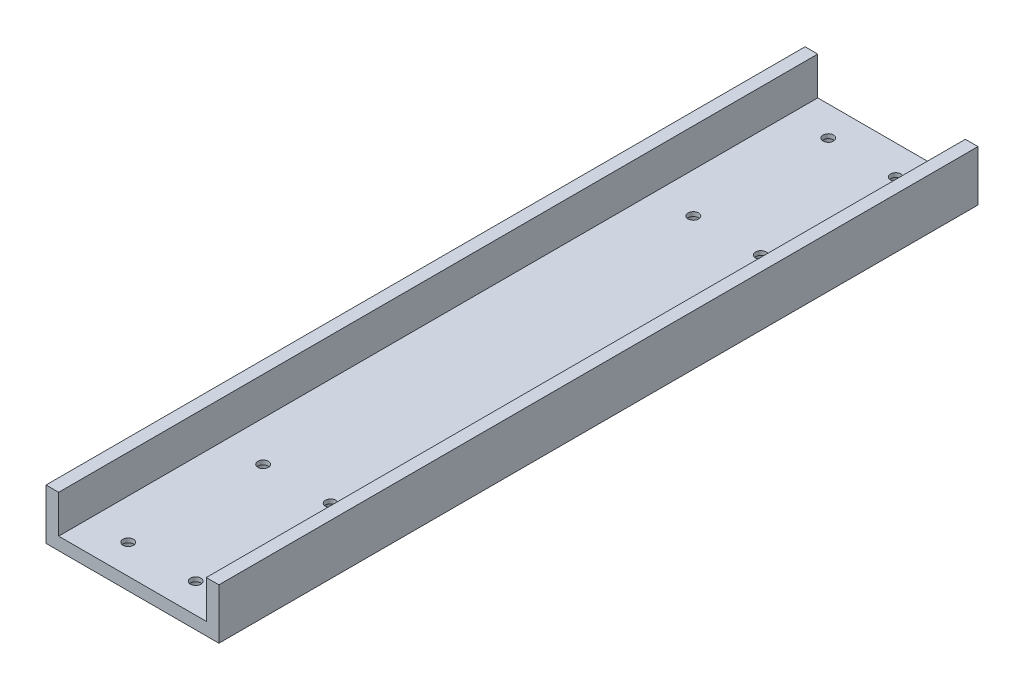
ISO-10303-21;
HEADER;
FILE_DESCRIPTION(('STEP AP214'),'2;1');
FILE_NAME('part.step','',(''),(''),'','','');
FILE_SCHEMA(('AUTOMOTIVE_DESIGN { 1 0 10303 214 1 1 1 1 }'));
ENDSEC;
DATA;
#1=APPLICATION_CONTEXT('core data for automotive mechanical design processes');
#2=APPLICATION_PROTOCOL_DEFINITION('international standard','automotive_design',2000,#1);
#3=PRODUCT_CONTEXT('',#1,'mechanical');
#4=PRODUCT('Part','Part','',(#3));
#5=PRODUCT_RELATED_PRODUCT_CATEGORY('part','',(#4));
#6=PRODUCT_DEFINITION_FORMATION('','',#4);
#7=PRODUCT_DEFINITION_CONTEXT('part definition',#1,'design');
#8=PRODUCT_DEFINITION('design','',#6,#7);
#9=PRODUCT_DEFINITION_SHAPE('','',#8);
#10=(LENGTH_UNIT() NAMED_UNIT(*) SI_UNIT(.MILLI.,.METRE.));
#11=(NAMED_UNIT(*) PLANE_ANGLE_UNIT() SI_UNIT($,.RADIAN.));
#12=(NAMED_UNIT(*) SI_UNIT($,.STERADIAN.) SOLID_ANGLE_UNIT());
#13=UNCERTAINTY_MEASURE_WITH_UNIT(LENGTH_MEASURE(1.E-05),#10,'distance_accuracy_value','');
#14=(GEOMETRIC_REPRESENTATION_CONTEXT(3) GLOBAL_UNCERTAINTY_ASSIGNED_CONTEXT((#13)) GLOBAL_UNIT_ASSIGNED_CONTEXT((#10,
#11,#12)) REPRESENTATION_CONTEXT('',''));
#15=CARTESIAN_POINT('',(0.,0.,0.));
#16=DIRECTION('',(0.,0.,1.));
#17=DIRECTION('',(1.,0.,0.));
#18=AXIS2_PLACEMENT_3D('',#15,#16,#17);
#19=CARTESIAN_POINT('',(-7.99999999999967,10.5,-51.));
#20=DIRECTION('',(0.,-1.,0.));
#21=DIRECTION('',(0.,0.,-1.));
#22=AXIS2_PLACEMENT_3D('',#19,#20,#21);
#23=CYLINDRICAL_SURFACE('',#22,1.25);
#24=CARTESIAN_POINT('',(-7.99999999999967,1.5,-51.));
#25=DIRECTION('',(0.,1.,0.));
#26=DIRECTION('',(0.,0.,1.));
#27=AXIS2_PLACEMENT_3D('',#24,#25,#26);
#28=CIRCLE('',#27,1.25);
#29=CARTESIAN_POINT('',(-7.99999999999967,1.5,-49.75));
#30=VERTEX_POINT('',#29);
#31=EDGE_CURVE('E223',#30,#30,#28,.F.);
#32=ORIENTED_EDGE('',*,*,#31,.F.);
#33=EDGE_LOOP('',(#32));
#34=FACE_BOUND('',#33,.T.);
#35=CARTESIAN_POINT('',(-7.99999999999967,0.5,-51.));
#36=DIRECTION('',(0.,-1.,0.));
#37=DIRECTION('',(0.,0.,-1.));
#38=AXIS2_PLACEMENT_3D('',#35,#36,#37);
#39=CIRCLE('',#38,1.25);
#40=CARTESIAN_POINT('',(-7.99999999999967,0.5,-52.25));
#41=VERTEX_POINT('',#40);
#42=EDGE_CURVE('E41',#41,#41,#39,.T.);
#43=ORIENTED_EDGE('',*,*,#42,.T.);
#44=EDGE_LOOP('',(#43));
#45=FACE_BOUND('',#44,.T.);
#46=ADVANCED_FACE('F37',(#34,#45),#23,.F.);
#47=CARTESIAN_POINT('',(8.00000000000034,10.5,-51.));
#48=DIRECTION('',(0.,-1.,0.));
#49=DIRECTION('',(0.,0.,-1.));
#50=AXIS2_PLACEMENT_3D('',#47,#48,#49);
#51=CYLINDRICAL_SURFACE('',#50,1.25);
#52=CARTESIAN_POINT('',(8.00000000000034,1.5,-51.));
#53=DIRECTION('',(0.,1.,0.));
#54=DIRECTION('',(0.,0.,1.));
#55=AXIS2_PLACEMENT_3D('',#52,#53,#54);
#56=CIRCLE('',#55,1.25);
#57=CARTESIAN_POINT('',(8.00000000000034,1.5,-49.75));
#58=VERTEX_POINT('',#57);
#59=EDGE_CURVE('E226',#58,#58,#56,.F.);
#60=ORIENTED_EDGE('',*,*,#59,.F.);
#61=EDGE_LOOP('',(#60));
#62=FACE_BOUND('',#61,.T.);
#63=CARTESIAN_POINT('',(8.00000000000034,0.5,-51.));
#64=DIRECTION('',(0.,-1.,0.));
#65=DIRECTION('',(0.,0.,-1.));
#66=AXIS2_PLACEMENT_3D('',#63,#64,#65);
#67=CIRCLE('',#66,1.25);
#68=CARTESIAN_POINT('',(8.00000000000034,0.5,-52.25));
#69=VERTEX_POINT('',#68);
#70=EDGE_CURVE('E237',#69,#69,#67,.T.);
#71=ORIENTED_EDGE('',*,*,#70,.T.);
#72=EDGE_LOOP('',(#71));
#73=FACE_BOUND('',#72,.T.);
#74=ADVANCED_FACE('F289',(#62,#73),#51,.F.);
#75=CARTESIAN_POINT('',(8.,10.5,-83.));
#76=DIRECTION('',(0.,-1.,0.));
#77=DIRECTION('',(0.,0.,-1.));
#78=AXIS2_PLACEMENT_3D('',#75,#76,#77);
#79=CYLINDRICAL_SURFACE('',#78,1.25);
#80=CARTESIAN_POINT('',(8.,1.5,-83.));
#81=DIRECTION('',(0.,1.,0.));
#82=DIRECTION('',(0.,0.,1.));
#83=AXIS2_PLACEMENT_3D('',#80,#81,#82);
#84=CIRCLE('',#83,1.25);
#85=CARTESIAN_POINT('',(8.,1.5,-81.75));
#86=VERTEX_POINT('',#85);
#87=EDGE_CURVE('E129',#86,#86,#84,.F.);
#88=ORIENTED_EDGE('',*,*,#87,.F.);
#89=EDGE_LOOP('',(#88));
#90=FACE_BOUND('',#89,.T.);
#91=CARTESIAN_POINT('',(8.,0.5,-83.));
#92=DIRECTION('',(0.,-1.,0.));
#93=DIRECTION('',(0.,0.,-1.));
#94=AXIS2_PLACEMENT_3D('',#91,#92,#93);
#95=CIRCLE('',#94,1.25);
#96=CARTESIAN_POINT('',(8.,0.5,-84.25));
#97=VERTEX_POINT('',#96);
#98=EDGE_CURVE('E235',#97,#97,#95,.T.);
#99=ORIENTED_EDGE('',*,*,#98,.T.);
#100=EDGE_LOOP('',(#99));
#101=FACE_BOUND('',#100,.T.);
#102=ADVANCED_FACE('F295',(#90,#101),#79,.F.);
#103=CARTESIAN_POINT('',(-8.,10.5,-83.));
#104=DIRECTION('',(0.,-1.,0.));
#105=DIRECTION('',(0.,0.,-1.));
#106=AXIS2_PLACEMENT_3D('',#103,#104,#105);
#107=CYLINDRICAL_SURFACE('',#106,1.25);
#108=CARTESIAN_POINT('',(-8.,1.5,-83.));
#109=DIRECTION('',(0.,1.,0.));
#110=DIRECTION('',(0.,0.,1.));
#111=AXIS2_PLACEMENT_3D('',#108,#109,#110);
#112=CIRCLE('',#111,1.25);
#113=CARTESIAN_POINT('',(-8.,1.5,-81.75));
#114=VERTEX_POINT('',#113);
#115=EDGE_CURVE('E126',#114,#114,#112,.F.);
#116=ORIENTED_EDGE('',*,*,#115,.F.);
#117=EDGE_LOOP('',(#116));
#118=FACE_BOUND('',#117,.T.);
#119=CARTESIAN_POINT('',(-8.,0.5,-83.));
#120=DIRECTION('',(0.,-1.,0.));
#121=DIRECTION('',(0.,0.,-1.));
#122=AXIS2_PLACEMENT_3D('',#119,#120,#121);
#123=CIRCLE('',#122,1.25);
#124=CARTESIAN_POINT('',(-8.,0.5,-84.25));
#125=VERTEX_POINT('',#124);
#126=EDGE_CURVE('E227',#125,#125,#123,.T.);
#127=ORIENTED_EDGE('',*,*,#126,.T.);
#128=EDGE_LOOP('',(#127));
#129=FACE_BOUND('',#128,.T.);
#130=ADVANCED_FACE('F301',(#118,#129),#107,.F.);
#131=CARTESIAN_POINT('',(-7.99999999999967,10.5,51.));
#132=DIRECTION('',(0.,-1.,0.));
#133=DIRECTION('',(0.,0.,-1.));
#134=AXIS2_PLACEMENT_3D('',#131,#132,#133);
#135=CYLINDRICAL_SURFACE('',#134,1.25);
#136=CARTESIAN_POINT('',(-7.99999999999967,1.5,51.));
#137=DIRECTION('',(0.,1.,0.));
#138=DIRECTION('',(0.,0.,1.));
#139=AXIS2_PLACEMENT_3D('',#136,#137,#138);
#140=CIRCLE('',#139,1.25);
#141=CARTESIAN_POINT('',(-7.99999999999967,1.5,52.25));
#142=VERTEX_POINT('',#141);
#143=EDGE_CURVE('E206',#142,#142,#140,.T.);
#144=ORIENTED_EDGE('',*,*,#143,.T.);
#145=EDGE_LOOP('',(#144));
#146=FACE_BOUND('',#145,.T.);
#147=CARTESIAN_POINT('',(-7.99999999999967,0.5,51.));
#148=DIRECTION('',(0.,-1.,0.));
#149=DIRECTION('',(0.,0.,-1.));
#150=AXIS2_PLACEMENT_3D('',#147,#148,#149);
#151=CIRCLE('',#150,1.25);
#152=CARTESIAN_POINT('',(-7.99999999999967,0.5,49.75));
#153=VERTEX_POINT('',#152);
#154=EDGE_CURVE('E174',#153,#153,#151,.F.);
#155=ORIENTED_EDGE('',*,*,#154,.F.);
#156=EDGE_LOOP('',(#155));
#157=FACE_BOUND('',#156,.T.);
#158=ADVANCED_FACE('F304',(#146,#157),#135,.F.);
#159=CARTESIAN_POINT('',(8.00000000000034,10.5,51.));
#160=DIRECTION('',(0.,-1.,0.));
#161=DIRECTION('',(0.,0.,-1.));
#162=AXIS2_PLACEMENT_3D('',#159,#160,#161);
#163=CYLINDRICAL_SURFACE('',#162,1.25);
#164=CARTESIAN_POINT('',(8.00000000000034,1.5,51.));
#165=DIRECTION('',(0.,1.,0.));
#166=DIRECTION('',(0.,0.,1.));
#167=AXIS2_PLACEMENT_3D('',#164,#165,#166);
#168=CIRCLE('',#167,1.25);
#169=CARTESIAN_POINT('',(8.00000000000034,1.5,52.25));
#170=VERTEX_POINT('',#169);
#171=EDGE_CURVE('E209',#170,#170,#168,.T.);
#172=ORIENTED_EDGE('',*,*,#171,.T.);
#173=EDGE_LOOP('',(#172));
#174=FACE_BOUND('',#173,.T.);
#175=CARTESIAN_POINT('',(8.00000000000034,0.5,51.));
#176=DIRECTION('',(0.,-1.,0.));
#177=DIRECTION('',(0.,0.,-1.));
#178=AXIS2_PLACEMENT_3D('',#175,#176,#177);
#179=CIRCLE('',#178,1.25);
#180=CARTESIAN_POINT('',(8.00000000000034,0.5,49.75));
#181=VERTEX_POINT('',#180);
#182=EDGE_CURVE('E218',#181,#181,#179,.F.);
#183=ORIENTED_EDGE('',*,*,#182,.F.);
#184=EDGE_LOOP('',(#183));
#185=FACE_BOUND('',#184,.T.);
#186=ADVANCED_FACE('F346',(#174,#185),#163,.F.);
#187=CARTESIAN_POINT('',(8.,10.5,83.));
#188=DIRECTION('',(0.,-1.,0.));
#189=DIRECTION('',(0.,0.,-1.));
#190=AXIS2_PLACEMENT_3D('',#187,#188,#189);
#191=CYLINDRICAL_SURFACE('',#190,1.25);
#192=CARTESIAN_POINT('',(8.,1.5,83.));
#193=DIRECTION('',(0.,1.,0.));
#194=DIRECTION('',(0.,0.,1.));
#195=AXIS2_PLACEMENT_3D('',#192,#193,#194);
#196=CIRCLE('',#195,1.25);
#197=CARTESIAN_POINT('',(8.,1.5,84.25));
#198=VERTEX_POINT('',#197);
#199=EDGE_CURVE('E205',#198,#198,#196,.T.);
#200=ORIENTED_EDGE('',*,*,#199,.T.);
#201=EDGE_LOOP('',(#200));
#202=FACE_BOUND('',#201,.T.);
#203=CARTESIAN_POINT('',(8.,0.5,83.));
#204=DIRECTION('',(0.,-1.,0.));
#205=DIRECTION('',(0.,0.,-1.));
#206=AXIS2_PLACEMENT_3D('',#203,#204,#205);
#207=CIRCLE('',#206,1.25);
#208=CARTESIAN_POINT('',(8.,0.5,81.75));
#209=VERTEX_POINT('',#208);
#210=EDGE_CURVE('E152',#209,#209,#207,.F.);
#211=ORIENTED_EDGE('',*,*,#210,.F.);
#212=EDGE_LOOP('',(#211));
#213=FACE_BOUND('',#212,.T.);
#214=ADVANCED_FACE('F342',(#202,#213),#191,.F.);
#215=CARTESIAN_POINT('',(-8.,10.5,83.));
#216=DIRECTION('',(0.,-1.,0.));
#217=DIRECTION('',(0.,0.,-1.));
#218=AXIS2_PLACEMENT_3D('',#215,#216,#217);
#219=CYLINDRICAL_SURFACE('',#218,1.25);
#220=CARTESIAN_POINT('',(-8.,1.5,83.));
#221=DIRECTION('',(0.,1.,0.));
#222=DIRECTION('',(0.,0.,1.));
#223=AXIS2_PLACEMENT_3D('',#220,#221,#222);
#224=CIRCLE('',#223,1.25);
#225=CARTESIAN_POINT('',(-8.,1.5,84.25));
#226=VERTEX_POINT('',#225);
#227=EDGE_CURVE('E177',#226,#226,#224,.T.);
#228=ORIENTED_EDGE('',*,*,#227,.T.);
#229=EDGE_LOOP('',(#228));
#230=FACE_BOUND('',#229,.T.);
#231=CARTESIAN_POINT('',(-8.,0.5,83.));
#232=DIRECTION('',(0.,-1.,0.));
#233=DIRECTION('',(0.,0.,-1.));
#234=AXIS2_PLACEMENT_3D('',#231,#232,#233);
#235=CIRCLE('',#234,1.25);
#236=CARTESIAN_POINT('',(-8.,0.5,81.75));
#237=VERTEX_POINT('',#236);
#238=EDGE_CURVE('E170',#237,#237,#235,.F.);
#239=ORIENTED_EDGE('',*,*,#238,.F.);
#240=EDGE_LOOP('',(#239));
#241=FACE_BOUND('',#240,.T.);
#242=ADVANCED_FACE('F345',(#230,#241),#219,.F.);
#243=CARTESIAN_POINT('',(0.,-1.5,90.));
#244=DIRECTION('',(0.,1.,0.));
#245=DIRECTION('',(0.,0.,1.));
#246=AXIS2_PLACEMENT_3D('',#243,#244,#245);
#247=PLANE('',#246);
#248=CARTESIAN_POINT('',(8.,-1.5,-83.));
#249=DIRECTION('',(0.,1.,0.));
#250=DIRECTION('',(0.,0.,1.));
#251=AXIS2_PLACEMENT_3D('',#248,#249,#250);
#252=CIRCLE('',#251,2.25);
#253=CARTESIAN_POINT('',(8.,-1.5,-80.75));
#254=VERTEX_POINT('',#253);
#255=EDGE_CURVE('E264',#254,#254,#252,.T.);
#256=ORIENTED_EDGE('',*,*,#255,.T.);
#257=EDGE_LOOP('',(#256));
#258=FACE_BOUND('',#257,.T.);
#259=CARTESIAN_POINT('',(8.00000000000034,-1.5,-51.));
#260=DIRECTION('',(0.,1.,0.));
#261=DIRECTION('',(0.,0.,1.));
#262=AXIS2_PLACEMENT_3D('',#259,#260,#261);
#263=CIRCLE('',#262,2.25);
#264=CARTESIAN_POINT('',(8.00000000000034,-1.5,-48.75));
#265=VERTEX_POINT('',#264);
#266=EDGE_CURVE('E258',#265,#265,#263,.T.);
#267=ORIENTED_EDGE('',*,*,#266,.T.);
#268=EDGE_LOOP('',(#267));
#269=FACE_BOUND('',#268,.T.);
#270=CARTESIAN_POINT('',(-7.99999999999967,-1.5,-51.));
#271=DIRECTION('',(0.,1.,0.));
#272=DIRECTION('',(0.,0.,1.));
#273=AXIS2_PLACEMENT_3D('',#270,#271,#272);
#274=CIRCLE('',#273,2.25);
#275=CARTESIAN_POINT('',(-7.99999999999967,-1.5,-48.75));
#276=VERTEX_POINT('',#275);
#277=EDGE_CURVE('E252',#276,#276,#274,.T.);
#278=ORIENTED_EDGE('',*,*,#277,.T.);
#279=EDGE_LOOP('',(#278));
#280=FACE_BOUND('',#279,.T.);
#281=CARTESIAN_POINT('',(-8.,-1.5,-83.));
#282=DIRECTION('',(0.,1.,0.));
#283=DIRECTION('',(0.,0.,1.));
#284=AXIS2_PLACEMENT_3D('',#281,#282,#283);
#285=CIRCLE('',#284,2.25);
#286=CARTESIAN_POINT('',(-8.,-1.5,-80.75));
#287=VERTEX_POINT('',#286);
#288=EDGE_CURVE('E132',#287,#287,#285,.T.);
#289=ORIENTED_EDGE('',*,*,#288,.T.);
#290=EDGE_LOOP('',(#289));
#291=FACE_BOUND('',#290,.T.);
#292=CARTESIAN_POINT('',(8.,-1.5,83.));
#293=DIRECTION('',(0.,-1.,0.));
#294=DIRECTION('',(0.,0.,-1.));
#295=AXIS2_PLACEMENT_3D('',#292,#293,#294);
#296=CIRCLE('',#295,2.25);
#297=CARTESIAN_POINT('',(8.,-1.5,80.75));
#298=VERTEX_POINT('',#297);
#299=EDGE_CURVE('E153',#298,#298,#296,.T.);
#300=ORIENTED_EDGE('',*,*,#299,.F.);
#301=EDGE_LOOP('',(#300));
#302=FACE_BOUND('',#301,.T.);
#303=CARTESIAN_POINT('',(8.00000000000034,-1.5,51.));
#304=DIRECTION('',(0.,-1.,0.));
#305=DIRECTION('',(0.,0.,-1.));
#306=AXIS2_PLACEMENT_3D('',#303,#304,#305);
#307=CIRCLE('',#306,2.25);
#308=CARTESIAN_POINT('',(8.00000000000034,-1.5,48.75));
#309=VERTEX_POINT('',#308);
#310=EDGE_CURVE('E159',#309,#309,#307,.T.);
#311=ORIENTED_EDGE('',*,*,#310,.F.);
#312=EDGE_LOOP('',(#311));
#313=FACE_BOUND('',#312,.T.);
#314=CARTESIAN_POINT('',(-7.99999999999967,-1.5,51.));
#315=DIRECTION('',(0.,-1.,0.));
#316=DIRECTION('',(0.,0.,-1.));
#317=AXIS2_PLACEMENT_3D('',#314,#315,#316);
#318=CIRCLE('',#317,2.25);
#319=CARTESIAN_POINT('',(-7.99999999999967,-1.5,48.75));
#320=VERTEX_POINT('',#319);
#321=EDGE_CURVE('E148',#320,#320,#318,.T.);
#322=ORIENTED_EDGE('',*,*,#321,.F.);
#323=EDGE_LOOP('',(#322));
#324=FACE_BOUND('',#323,.T.);
#325=CARTESIAN_POINT('',(-8.,-1.5,83.));
#326=DIRECTION('',(0.,-1.,0.));
#327=DIRECTION('',(0.,0.,-1.));
#328=AXIS2_PLACEMENT_3D('',#325,#326,#327);
#329=CIRCLE('',#328,2.25);
#330=CARTESIAN_POINT('',(-8.,-1.5,80.75));
#331=VERTEX_POINT('',#330);
#332=EDGE_CURVE('E171',#331,#331,#329,.T.);
#333=ORIENTED_EDGE('',*,*,#332,.F.);
#334=EDGE_LOOP('',(#333));
#335=FACE_BOUND('',#334,.T.);
#336=DIRECTION('',(0.,0.,-1.));
#337=VECTOR('',#336,1.);
#338=CARTESIAN_POINT('',(-20.5,-1.5,90.));
#339=LINE('',#338,#337);
#340=CARTESIAN_POINT('',(-20.5,-1.5,90.));
#341=VERTEX_POINT('',#340);
#342=CARTESIAN_POINT('',(-20.5,-1.5,-90.));
#343=VERTEX_POINT('',#342);
#344=EDGE_CURVE('E54',#341,#343,#339,.T.);
#345=ORIENTED_EDGE('',*,*,#344,.T.);
#346=DIRECTION('',(1.,0.,0.));
#347=VECTOR('',#346,1.);
#348=CARTESIAN_POINT('',(0.,-1.5,-90.));
#349=LINE('',#348,#347);
#350=CARTESIAN_POINT('',(20.5,-1.5,-90.));
#351=VERTEX_POINT('',#350);
#352=EDGE_CURVE('E107',#343,#351,#349,.T.);
#353=ORIENTED_EDGE('',*,*,#352,.T.);
#354=DIRECTION('',(0.,0.,-1.));
#355=VECTOR('',#354,1.);
#356=CARTESIAN_POINT('',(20.5,-1.5,90.));
#357=LINE('',#356,#355);
#358=CARTESIAN_POINT('',(20.5,-1.5,90.));
#359=VERTEX_POINT('',#358);
#360=EDGE_CURVE('E11',#359,#351,#357,.T.);
#361=ORIENTED_EDGE('',*,*,#360,.F.);
#362=DIRECTION('',(1.,0.,0.));
#363=VECTOR('',#362,1.);
#364=CARTESIAN_POINT('',(0.,-1.5,90.));
#365=LINE('',#364,#363);
#366=EDGE_CURVE('E110',#341,#359,#365,.T.);
#367=ORIENTED_EDGE('',*,*,#366,.F.);
#368=EDGE_LOOP('',(#345,#353,#361,#367));
#369=FACE_BOUND('',#368,.T.);
#370=ADVANCED_FACE('F39',(#258,#269,#280,#291,#302,#313,#324,#335,#369),#247,.F.);
#371=CARTESIAN_POINT('',(20.5,0.,90.));
#372=DIRECTION('',(-1.,0.,0.));
#373=DIRECTION('',(0.,0.,1.));
#374=AXIS2_PLACEMENT_3D('',#371,#372,#373);
#375=PLANE('',#374);
#376=ORIENTED_EDGE('',*,*,#360,.T.);
#377=DIRECTION('',(0.,1.,0.));
#378=VECTOR('',#377,1.);
#379=CARTESIAN_POINT('',(20.5,0.,-90.));
#380=LINE('',#379,#378);
#381=CARTESIAN_POINT('',(20.5,10.5,-90.));
#382=VERTEX_POINT('',#381);
#383=EDGE_CURVE('E125',#351,#382,#380,.T.);
#384=ORIENTED_EDGE('',*,*,#383,.T.);
#385=DIRECTION('',(0.,0.,-1.));
#386=VECTOR('',#385,1.);
#387=CARTESIAN_POINT('',(20.5,10.5,90.));
#388=LINE('',#387,#386);
#389=CARTESIAN_POINT('',(20.5,10.5,90.));
#390=VERTEX_POINT('',#389);
#391=EDGE_CURVE('E46',#390,#382,#388,.T.);
#392=ORIENTED_EDGE('',*,*,#391,.F.);
#393=DIRECTION('',(0.,1.,0.));
#394=VECTOR('',#393,1.);
#395=CARTESIAN_POINT('',(20.5,0.,90.));
#396=LINE('',#395,#394);
#397=EDGE_CURVE('E176',#359,#390,#396,.T.);
#398=ORIENTED_EDGE('',*,*,#397,.F.);
#399=EDGE_LOOP('',(#376,#384,#392,#398));
#400=FACE_BOUND('',#399,.T.);
#401=ADVANCED_FACE('F379',(#400),#375,.F.);
#402=CARTESIAN_POINT('',(0.,10.5,90.));
#403=DIRECTION('',(0.,1.,0.));
#404=DIRECTION('',(0.,0.,1.));
#405=AXIS2_PLACEMENT_3D('',#402,#403,#404);
#406=PLANE('',#405);
#407=ORIENTED_EDGE('',*,*,#391,.T.);
#408=DIRECTION('',(1.,0.,0.));
#409=VECTOR('',#408,1.);
#410=CARTESIAN_POINT('',(0.,10.5,-90.));
#411=LINE('',#410,#409);
#412=CARTESIAN_POINT('',(17.5,10.5,-90.));
#413=VERTEX_POINT('',#412);
#414=EDGE_CURVE('E145',#413,#382,#411,.T.);
#415=ORIENTED_EDGE('',*,*,#414,.F.);
#416=DIRECTION('',(0.,0.,-1.));
#417=VECTOR('',#416,1.);
#418=CARTESIAN_POINT('',(17.5,10.5,90.));
#419=LINE('',#418,#417);
#420=CARTESIAN_POINT('',(17.5,10.5,90.));
#421=VERTEX_POINT('',#420);
#422=EDGE_CURVE('E200',#421,#413,#419,.T.);
#423=ORIENTED_EDGE('',*,*,#422,.F.);
#424=DIRECTION('',(1.,0.,0.));
#425=VECTOR('',#424,1.);
#426=CARTESIAN_POINT('',(0.,10.5,90.));
#427=LINE('',#426,#425);
#428=EDGE_CURVE('E179',#421,#390,#427,.T.);
#429=ORIENTED_EDGE('',*,*,#428,.T.);
#430=EDGE_LOOP('',(#407,#415,#423,#429));
#431=FACE_BOUND('',#430,.T.);
#432=ADVANCED_FACE('F376',(#431),#406,.T.);
#433=CARTESIAN_POINT('',(17.5,0.,90.));
#434=DIRECTION('',(-1.,0.,0.));
#435=DIRECTION('',(0.,0.,1.));
#436=AXIS2_PLACEMENT_3D('',#433,#434,#435);
#437=PLANE('',#436);
#438=ORIENTED_EDGE('',*,*,#422,.T.);
#439=DIRECTION('',(0.,1.,0.));
#440=VECTOR('',#439,1.);
#441=CARTESIAN_POINT('',(17.5,0.,-90.));
#442=LINE('',#441,#440);
#443=CARTESIAN_POINT('',(17.5,1.5,-90.));
#444=VERTEX_POINT('',#443);
#445=EDGE_CURVE('E142',#444,#413,#442,.T.);
#446=ORIENTED_EDGE('',*,*,#445,.F.);
#447=DIRECTION('',(0.,0.,-1.));
#448=VECTOR('',#447,1.);
#449=CARTESIAN_POINT('',(17.5,1.5,90.));
#450=LINE('',#449,#448);
#451=CARTESIAN_POINT('',(17.5,1.5,90.));
#452=VERTEX_POINT('',#451);
#453=EDGE_CURVE('E198',#452,#444,#450,.T.);
#454=ORIENTED_EDGE('',*,*,#453,.F.);
#455=DIRECTION('',(0.,1.,0.));
#456=VECTOR('',#455,1.);
#457=CARTESIAN_POINT('',(17.5,0.,90.));
#458=LINE('',#457,#456);
#459=EDGE_CURVE('E182',#452,#421,#458,.T.);
#460=ORIENTED_EDGE('',*,*,#459,.T.);
#461=EDGE_LOOP('',(#438,#446,#454,#460));
#462=FACE_BOUND('',#461,.T.);
#463=ADVANCED_FACE('F372',(#462),#437,.T.);
#464=CARTESIAN_POINT('',(0.,1.5,90.));
#465=DIRECTION('',(0.,1.,0.));
#466=DIRECTION('',(0.,0.,1.));
#467=AXIS2_PLACEMENT_3D('',#464,#465,#466);
#468=PLANE('',#467);
#469=ORIENTED_EDGE('',*,*,#87,.T.);
#470=EDGE_LOOP('',(#469));
#471=FACE_BOUND('',#470,.T.);
#472=ORIENTED_EDGE('',*,*,#59,.T.);
#473=EDGE_LOOP('',(#472));
#474=FACE_BOUND('',#473,.T.);
#475=ORIENTED_EDGE('',*,*,#31,.T.);
#476=EDGE_LOOP('',(#475));
#477=FACE_BOUND('',#476,.T.);
#478=ORIENTED_EDGE('',*,*,#115,.T.);
#479=EDGE_LOOP('',(#478));
#480=FACE_BOUND('',#479,.T.);
#481=ORIENTED_EDGE('',*,*,#199,.F.);
#482=EDGE_LOOP('',(#481));
#483=FACE_BOUND('',#482,.T.);
#484=ORIENTED_EDGE('',*,*,#171,.F.);
#485=EDGE_LOOP('',(#484));
#486=FACE_BOUND('',#485,.T.);
#487=ORIENTED_EDGE('',*,*,#143,.F.);
#488=EDGE_LOOP('',(#487));
#489=FACE_BOUND('',#488,.T.);
#490=ORIENTED_EDGE('',*,*,#227,.F.);
#491=EDGE_LOOP('',(#490));
#492=FACE_BOUND('',#491,.T.);
#493=ORIENTED_EDGE('',*,*,#453,.T.);
#494=DIRECTION('',(1.,0.,0.));
#495=VECTOR('',#494,1.);
#496=CARTESIAN_POINT('',(0.,1.5,-90.));
#497=LINE('',#496,#495);
#498=CARTESIAN_POINT('',(-17.5,1.5,-90.));
#499=VERTEX_POINT('',#498);
#500=EDGE_CURVE('E139',#499,#444,#497,.T.);
#501=ORIENTED_EDGE('',*,*,#500,.F.);
#502=DIRECTION('',(0.,0.,-1.));
#503=VECTOR('',#502,1.);
#504=CARTESIAN_POINT('',(-17.5,1.5,90.));
#505=LINE('',#504,#503);
#506=CARTESIAN_POINT('',(-17.5,1.5,90.));
#507=VERTEX_POINT('',#506);
#508=EDGE_CURVE('E196',#507,#499,#505,.T.);
#509=ORIENTED_EDGE('',*,*,#508,.F.);
#510=DIRECTION('',(1.,0.,0.));
#511=VECTOR('',#510,1.);
#512=CARTESIAN_POINT('',(0.,1.5,90.));
#513=LINE('',#512,#511);
#514=EDGE_CURVE('E185',#507,#452,#513,.T.);
#515=ORIENTED_EDGE('',*,*,#514,.T.);
#516=EDGE_LOOP('',(#493,#501,#509,#515));
#517=FACE_BOUND('',#516,.T.);
#518=ADVANCED_FACE('F368',(#471,#474,#477,#480,#483,#486,#489,#492,#517),#468,.T.);
#519=CARTESIAN_POINT('',(-17.5,0.,90.));
#520=DIRECTION('',(1.,0.,0.));
#521=DIRECTION('',(0.,0.,-1.));
#522=AXIS2_PLACEMENT_3D('',#519,#520,#521);
#523=PLANE('',#522);
#524=ORIENTED_EDGE('',*,*,#508,.T.);
#525=DIRECTION('',(0.,-1.,0.));
#526=VECTOR('',#525,1.);
#527=CARTESIAN_POINT('',(-17.5,0.,-90.));
#528=LINE('',#527,#526);
#529=CARTESIAN_POINT('',(-17.5,10.5,-90.));
#530=VERTEX_POINT('',#529);
#531=EDGE_CURVE('E136',#530,#499,#528,.T.);
#532=ORIENTED_EDGE('',*,*,#531,.F.);
#533=DIRECTION('',(0.,0.,-1.));
#534=VECTOR('',#533,1.);
#535=CARTESIAN_POINT('',(-17.5,10.5,90.));
#536=LINE('',#535,#534);
#537=CARTESIAN_POINT('',(-17.5,10.5,90.));
#538=VERTEX_POINT('',#537);
#539=EDGE_CURVE('E194',#538,#530,#536,.T.);
#540=ORIENTED_EDGE('',*,*,#539,.F.);
#541=DIRECTION('',(0.,-1.,0.));
#542=VECTOR('',#541,1.);
#543=CARTESIAN_POINT('',(-17.5,0.,90.));
#544=LINE('',#543,#542);
#545=EDGE_CURVE('E188',#538,#507,#544,.T.);
#546=ORIENTED_EDGE('',*,*,#545,.T.);
#547=EDGE_LOOP('',(#524,#532,#540,#546));
#548=FACE_BOUND('',#547,.T.);
#549=ADVANCED_FACE('F364',(#548),#523,.T.);
#550=CARTESIAN_POINT('',(0.,10.5,90.));
#551=DIRECTION('',(0.,-1.,0.));
#552=DIRECTION('',(1.,0.,0.));
#553=AXIS2_PLACEMENT_3D('',#550,#551,#552);
#554=PLANE('',#553);
#555=ORIENTED_EDGE('',*,*,#539,.T.);
#556=DIRECTION('',(-1.,0.,0.));
#557=VECTOR('',#556,1.);
#558=CARTESIAN_POINT('',(0.,10.5,-90.));
#559=LINE('',#558,#557);
#560=CARTESIAN_POINT('',(-20.5,10.5,-90.));
#561=VERTEX_POINT('',#560);
#562=EDGE_CURVE('E120',#530,#561,#559,.T.);
#563=ORIENTED_EDGE('',*,*,#562,.T.);
#564=DIRECTION('',(0.,0.,-1.));
#565=VECTOR('',#564,1.);
#566=CARTESIAN_POINT('',(-20.5,10.5,90.));
#567=LINE('',#566,#565);
#568=CARTESIAN_POINT('',(-20.5,10.5,90.));
#569=VERTEX_POINT('',#568);
#570=EDGE_CURVE('E111',#569,#561,#567,.T.);
#571=ORIENTED_EDGE('',*,*,#570,.F.);
#572=DIRECTION('',(-1.,0.,0.));
#573=VECTOR('',#572,1.);
#574=CARTESIAN_POINT('',(0.,10.5,90.));
#575=LINE('',#574,#573);
#576=EDGE_CURVE('E62',#538,#569,#575,.T.);
#577=ORIENTED_EDGE('',*,*,#576,.F.);
#578=EDGE_LOOP('',(#555,#563,#571,#577));
#579=FACE_BOUND('',#578,.T.);
#580=ADVANCED_FACE('F361',(#579),#554,.F.);
#581=CARTESIAN_POINT('',(-20.5,0.,90.));
#582=DIRECTION('',(-1.,0.,0.));
#583=DIRECTION('',(0.,0.,1.));
#584=AXIS2_PLACEMENT_3D('',#581,#582,#583);
#585=PLANE('',#584);
#586=ORIENTED_EDGE('',*,*,#570,.T.);
#587=DIRECTION('',(0.,1.,0.));
#588=VECTOR('',#587,1.);
#589=CARTESIAN_POINT('',(-20.5,0.,-90.));
#590=LINE('',#589,#588);
#591=EDGE_CURVE('E115',#343,#561,#590,.T.);
#592=ORIENTED_EDGE('',*,*,#591,.F.);
#593=ORIENTED_EDGE('',*,*,#344,.F.);
#594=DIRECTION('',(0.,1.,0.));
#595=VECTOR('',#594,1.);
#596=CARTESIAN_POINT('',(-20.5,0.,90.));
#597=LINE('',#596,#595);
#598=EDGE_CURVE('E112',#341,#569,#597,.T.);
#599=ORIENTED_EDGE('',*,*,#598,.T.);
#600=EDGE_LOOP('',(#586,#592,#593,#599));
#601=FACE_BOUND('',#600,.T.);
#602=ADVANCED_FACE('F116',(#601),#585,.T.);
#603=CARTESIAN_POINT('',(0.,0.,90.));
#604=DIRECTION('',(0.,0.,1.));
#605=DIRECTION('',(1.,0.,0.));
#606=AXIS2_PLACEMENT_3D('',#603,#604,#605);
#607=PLANE('',#606);
#608=ORIENTED_EDGE('',*,*,#366,.T.);
#609=ORIENTED_EDGE('',*,*,#397,.T.);
#610=ORIENTED_EDGE('',*,*,#428,.F.);
#611=ORIENTED_EDGE('',*,*,#459,.F.);
#612=ORIENTED_EDGE('',*,*,#514,.F.);
#613=ORIENTED_EDGE('',*,*,#545,.F.);
#614=ORIENTED_EDGE('',*,*,#576,.T.);
#615=ORIENTED_EDGE('',*,*,#598,.F.);
#616=EDGE_LOOP('',(#608,#609,#610,#611,#612,#613,#614,#615));
#617=FACE_BOUND('',#616,.T.);
#618=ADVANCED_FACE('F337',(#617),#607,.T.);
#619=CARTESIAN_POINT('',(-8.,0.5,83.));
#620=DIRECTION('',(0.,-1.,0.));
#621=DIRECTION('',(0.,0.,-1.));
#622=AXIS2_PLACEMENT_3D('',#619,#620,#621);
#623=PLANE('',#622);
#624=CARTESIAN_POINT('',(-8.,0.5,83.));
#625=DIRECTION('',(0.,-1.,0.));
#626=DIRECTION('',(0.,0.,-1.));
#627=AXIS2_PLACEMENT_3D('',#624,#625,#626);
#628=CIRCLE('',#627,2.25);
#629=CARTESIAN_POINT('',(-8.,0.5,80.75));
#630=VERTEX_POINT('',#629);
#631=EDGE_CURVE('E167',#630,#630,#628,.T.);
#632=ORIENTED_EDGE('',*,*,#631,.T.);
#633=EDGE_LOOP('',(#632));
#634=FACE_BOUND('',#633,.T.);
#635=ORIENTED_EDGE('',*,*,#238,.T.);
#636=EDGE_LOOP('',(#635));
#637=FACE_BOUND('',#636,.T.);
#638=ADVANCED_FACE('F334',(#634,#637),#623,.T.);
#639=CARTESIAN_POINT('',(-8.,0.5,83.));
#640=DIRECTION('',(0.,-1.,0.));
#641=DIRECTION('',(0.,0.,-1.));
#642=AXIS2_PLACEMENT_3D('',#639,#640,#641);
#643=CYLINDRICAL_SURFACE('',#642,2.25);
#644=ORIENTED_EDGE('',*,*,#631,.F.);
#645=EDGE_LOOP('',(#644));
#646=FACE_BOUND('',#645,.T.);
#647=ORIENTED_EDGE('',*,*,#332,.T.);
#648=EDGE_LOOP('',(#647));
#649=FACE_BOUND('',#648,.T.);
#650=ADVANCED_FACE('F314',(#646,#649),#643,.F.);
#651=CARTESIAN_POINT('',(8.,0.5,83.));
#652=DIRECTION('',(0.,-1.,0.));
#653=DIRECTION('',(0.,0.,-1.));
#654=AXIS2_PLACEMENT_3D('',#651,#652,#653);
#655=PLANE('',#654);
#656=CARTESIAN_POINT('',(8.,0.5,83.));
#657=DIRECTION('',(0.,-1.,0.));
#658=DIRECTION('',(0.,0.,-1.));
#659=AXIS2_PLACEMENT_3D('',#656,#657,#658);
#660=CIRCLE('',#659,2.25);
#661=CARTESIAN_POINT('',(8.,0.5,80.75));
#662=VERTEX_POINT('',#661);
#663=EDGE_CURVE('E149',#662,#662,#660,.T.);
#664=ORIENTED_EDGE('',*,*,#663,.T.);
#665=EDGE_LOOP('',(#664));
#666=FACE_BOUND('',#665,.T.);
#667=ORIENTED_EDGE('',*,*,#210,.T.);
#668=EDGE_LOOP('',(#667));
#669=FACE_BOUND('',#668,.T.);
#670=ADVANCED_FACE('F310',(#666,#669),#655,.T.);
#671=CARTESIAN_POINT('',(8.,0.5,83.));
#672=DIRECTION('',(0.,-1.,0.));
#673=DIRECTION('',(0.,0.,-1.));
#674=AXIS2_PLACEMENT_3D('',#671,#672,#673);
#675=CYLINDRICAL_SURFACE('',#674,2.25);
#676=ORIENTED_EDGE('',*,*,#663,.F.);
#677=EDGE_LOOP('',(#676));
#678=FACE_BOUND('',#677,.T.);
#679=ORIENTED_EDGE('',*,*,#299,.T.);
#680=EDGE_LOOP('',(#679));
#681=FACE_BOUND('',#680,.T.);
#682=ADVANCED_FACE('F313',(#678,#681),#675,.F.);
#683=CARTESIAN_POINT('',(8.00000000000034,0.5,51.));
#684=DIRECTION('',(0.,-1.,0.));
#685=DIRECTION('',(0.,0.,-1.));
#686=AXIS2_PLACEMENT_3D('',#683,#684,#685);
#687=PLANE('',#686);
#688=CARTESIAN_POINT('',(8.00000000000034,0.5,51.));
#689=DIRECTION('',(0.,-1.,0.));
#690=DIRECTION('',(0.,0.,-1.));
#691=AXIS2_PLACEMENT_3D('',#688,#689,#690);
#692=CIRCLE('',#691,2.25);
#693=CARTESIAN_POINT('',(8.00000000000034,0.5,48.75));
#694=VERTEX_POINT('',#693);
#695=EDGE_CURVE('E156',#694,#694,#692,.T.);
#696=ORIENTED_EDGE('',*,*,#695,.T.);
#697=EDGE_LOOP('',(#696));
#698=FACE_BOUND('',#697,.T.);
#699=ORIENTED_EDGE('',*,*,#182,.T.);
#700=EDGE_LOOP('',(#699));
#701=FACE_BOUND('',#700,.T.);
#702=ADVANCED_FACE('F318',(#698,#701),#687,.T.);
#703=CARTESIAN_POINT('',(8.00000000000034,0.5,51.));
#704=DIRECTION('',(0.,-1.,0.));
#705=DIRECTION('',(0.,0.,-1.));
#706=AXIS2_PLACEMENT_3D('',#703,#704,#705);
#707=CYLINDRICAL_SURFACE('',#706,2.25);
#708=ORIENTED_EDGE('',*,*,#695,.F.);
#709=EDGE_LOOP('',(#708));
#710=FACE_BOUND('',#709,.T.);
#711=ORIENTED_EDGE('',*,*,#310,.T.);
#712=EDGE_LOOP('',(#711));
#713=FACE_BOUND('',#712,.T.);
#714=ADVANCED_FACE('F322',(#710,#713),#707,.F.);
#715=CARTESIAN_POINT('',(-7.99999999999967,0.5,51.));
#716=DIRECTION('',(0.,-1.,0.));
#717=DIRECTION('',(0.,0.,-1.));
#718=AXIS2_PLACEMENT_3D('',#715,#716,#717);
#719=PLANE('',#718);
#720=CARTESIAN_POINT('',(-7.99999999999967,0.5,51.));
#721=DIRECTION('',(0.,-1.,0.));
#722=DIRECTION('',(0.,0.,-1.));
#723=AXIS2_PLACEMENT_3D('',#720,#721,#722);
#724=CIRCLE('',#723,2.25);
#725=CARTESIAN_POINT('',(-7.99999999999967,0.5,48.75));
#726=VERTEX_POINT('',#725);
#727=EDGE_CURVE('E162',#726,#726,#724,.T.);
#728=ORIENTED_EDGE('',*,*,#727,.T.);
#729=EDGE_LOOP('',(#728));
#730=FACE_BOUND('',#729,.T.);
#731=ORIENTED_EDGE('',*,*,#154,.T.);
#732=EDGE_LOOP('',(#731));
#733=FACE_BOUND('',#732,.T.);
#734=ADVANCED_FACE('F326',(#730,#733),#719,.T.);
#735=CARTESIAN_POINT('',(-7.99999999999967,0.5,51.));
#736=DIRECTION('',(0.,-1.,0.));
#737=DIRECTION('',(0.,0.,-1.));
#738=AXIS2_PLACEMENT_3D('',#735,#736,#737);
#739=CYLINDRICAL_SURFACE('',#738,2.25);
#740=ORIENTED_EDGE('',*,*,#727,.F.);
#741=EDGE_LOOP('',(#740));
#742=FACE_BOUND('',#741,.T.);
#743=ORIENTED_EDGE('',*,*,#321,.T.);
#744=EDGE_LOOP('',(#743));
#745=FACE_BOUND('',#744,.T.);
#746=ADVANCED_FACE('F309',(#742,#745),#739,.F.);
#747=CARTESIAN_POINT('',(0.,0.,-90.));
#748=DIRECTION('',(0.,0.,-1.));
#749=DIRECTION('',(1.,0.,0.));
#750=AXIS2_PLACEMENT_3D('',#747,#748,#749);
#751=PLANE('',#750);
#752=ORIENTED_EDGE('',*,*,#352,.F.);
#753=ORIENTED_EDGE('',*,*,#591,.T.);
#754=ORIENTED_EDGE('',*,*,#562,.F.);
#755=ORIENTED_EDGE('',*,*,#531,.T.);
#756=ORIENTED_EDGE('',*,*,#500,.T.);
#757=ORIENTED_EDGE('',*,*,#445,.T.);
#758=ORIENTED_EDGE('',*,*,#414,.T.);
#759=ORIENTED_EDGE('',*,*,#383,.F.);
#760=EDGE_LOOP('',(#752,#753,#754,#755,#756,#757,#758,#759));
#761=FACE_BOUND('',#760,.T.);
#762=ADVANCED_FACE('F122',(#761),#751,.T.);
#763=CARTESIAN_POINT('',(-8.,0.5,-83.));
#764=DIRECTION('',(0.,-1.,0.));
#765=DIRECTION('',(0.,0.,-1.));
#766=AXIS2_PLACEMENT_3D('',#763,#764,#765);
#767=CYLINDRICAL_SURFACE('',#766,2.25);
#768=CARTESIAN_POINT('',(-8.,0.5,-83.));
#769=DIRECTION('',(0.,1.,0.));
#770=DIRECTION('',(0.,0.,1.));
#771=AXIS2_PLACEMENT_3D('',#768,#769,#770);
#772=CIRCLE('',#771,2.25);
#773=CARTESIAN_POINT('',(-8.,0.5,-80.75));
#774=VERTEX_POINT('',#773);
#775=EDGE_CURVE('E234',#774,#774,#772,.T.);
#776=ORIENTED_EDGE('',*,*,#775,.T.);
#777=EDGE_LOOP('',(#776));
#778=FACE_BOUND('',#777,.T.);
#779=ORIENTED_EDGE('',*,*,#288,.F.);
#780=EDGE_LOOP('',(#779));
#781=FACE_BOUND('',#780,.T.);
#782=ADVANCED_FACE('F308',(#778,#781),#767,.F.);
#783=CARTESIAN_POINT('',(-8.,0.5,-83.));
#784=DIRECTION('',(0.,-1.,0.));
#785=DIRECTION('',(0.,0.,1.));
#786=AXIS2_PLACEMENT_3D('',#783,#784,#785);
#787=PLANE('',#786);
#788=ORIENTED_EDGE('',*,*,#126,.F.);
#789=EDGE_LOOP('',(#788));
#790=FACE_BOUND('',#789,.T.);
#791=ORIENTED_EDGE('',*,*,#775,.F.);
#792=EDGE_LOOP('',(#791));
#793=FACE_BOUND('',#792,.T.);
#794=ADVANCED_FACE('F285',(#790,#793),#787,.T.);
#795=CARTESIAN_POINT('',(8.,0.5,-83.));
#796=DIRECTION('',(0.,-1.,0.));
#797=DIRECTION('',(0.,0.,-1.));
#798=AXIS2_PLACEMENT_3D('',#795,#796,#797);
#799=CYLINDRICAL_SURFACE('',#798,2.25);
#800=CARTESIAN_POINT('',(8.,0.5,-83.));
#801=DIRECTION('',(0.,1.,0.));
#802=DIRECTION('',(0.,0.,1.));
#803=AXIS2_PLACEMENT_3D('',#800,#801,#802);
#804=CIRCLE('',#803,2.25);
#805=CARTESIAN_POINT('',(8.,0.5,-80.75));
#806=VERTEX_POINT('',#805);
#807=EDGE_CURVE('E238',#806,#806,#804,.T.);
#808=ORIENTED_EDGE('',*,*,#807,.T.);
#809=EDGE_LOOP('',(#808));
#810=FACE_BOUND('',#809,.T.);
#811=ORIENTED_EDGE('',*,*,#255,.F.);
#812=EDGE_LOOP('',(#811));
#813=FACE_BOUND('',#812,.T.);
#814=ADVANCED_FACE('F270',(#810,#813),#799,.F.);
#815=CARTESIAN_POINT('',(8.,0.5,-83.));
#816=DIRECTION('',(0.,-1.,0.));
#817=DIRECTION('',(0.,0.,1.));
#818=AXIS2_PLACEMENT_3D('',#815,#816,#817);
#819=PLANE('',#818);
#820=ORIENTED_EDGE('',*,*,#98,.F.);
#821=EDGE_LOOP('',(#820));
#822=FACE_BOUND('',#821,.T.);
#823=ORIENTED_EDGE('',*,*,#807,.F.);
#824=EDGE_LOOP('',(#823));
#825=FACE_BOUND('',#824,.T.);
#826=ADVANCED_FACE('F273',(#822,#825),#819,.T.);
#827=CARTESIAN_POINT('',(8.00000000000034,0.5,-51.));
#828=DIRECTION('',(0.,-1.,0.));
#829=DIRECTION('',(0.,0.,-1.));
#830=AXIS2_PLACEMENT_3D('',#827,#828,#829);
#831=CYLINDRICAL_SURFACE('',#830,2.25);
#832=CARTESIAN_POINT('',(8.00000000000034,0.5,-51.));
#833=DIRECTION('',(0.,1.,0.));
#834=DIRECTION('',(0.,0.,1.));
#835=AXIS2_PLACEMENT_3D('',#832,#833,#834);
#836=CIRCLE('',#835,2.25);
#837=CARTESIAN_POINT('',(8.00000000000034,0.5,-48.75));
#838=VERTEX_POINT('',#837);
#839=EDGE_CURVE('E261',#838,#838,#836,.T.);
#840=ORIENTED_EDGE('',*,*,#839,.T.);
#841=EDGE_LOOP('',(#840));
#842=FACE_BOUND('',#841,.T.);
#843=ORIENTED_EDGE('',*,*,#266,.F.);
#844=EDGE_LOOP('',(#843));
#845=FACE_BOUND('',#844,.T.);
#846=ADVANCED_FACE('F275',(#842,#845),#831,.F.);
#847=CARTESIAN_POINT('',(8.00000000000034,0.5,-51.));
#848=DIRECTION('',(0.,-1.,0.));
#849=DIRECTION('',(0.,0.,1.));
#850=AXIS2_PLACEMENT_3D('',#847,#848,#849);
#851=PLANE('',#850);
#852=ORIENTED_EDGE('',*,*,#70,.F.);
#853=EDGE_LOOP('',(#852));
#854=FACE_BOUND('',#853,.T.);
#855=ORIENTED_EDGE('',*,*,#839,.F.);
#856=EDGE_LOOP('',(#855));
#857=FACE_BOUND('',#856,.T.);
#858=ADVANCED_FACE('F282',(#854,#857),#851,.T.);
#859=CARTESIAN_POINT('',(-7.99999999999967,0.5,-51.));
#860=DIRECTION('',(0.,-1.,0.));
#861=DIRECTION('',(0.,0.,-1.));
#862=AXIS2_PLACEMENT_3D('',#859,#860,#861);
#863=CYLINDRICAL_SURFACE('',#862,2.25);
#864=CARTESIAN_POINT('',(-7.99999999999967,0.5,-51.));
#865=DIRECTION('',(0.,1.,0.));
#866=DIRECTION('',(0.,0.,1.));
#867=AXIS2_PLACEMENT_3D('',#864,#865,#866);
#868=CIRCLE('',#867,2.25);
#869=CARTESIAN_POINT('',(-7.99999999999967,0.5,-48.75));
#870=VERTEX_POINT('',#869);
#871=EDGE_CURVE('E255',#870,#870,#868,.T.);
#872=ORIENTED_EDGE('',*,*,#871,.T.);
#873=EDGE_LOOP('',(#872));
#874=FACE_BOUND('',#873,.T.);
#875=ORIENTED_EDGE('',*,*,#277,.F.);
#876=EDGE_LOOP('',(#875));
#877=FACE_BOUND('',#876,.T.);
#878=ADVANCED_FACE('F416',(#874,#877),#863,.F.);
#879=CARTESIAN_POINT('',(-7.99999999999967,0.5,-51.));
#880=DIRECTION('',(0.,-1.,0.));
#881=DIRECTION('',(0.,0.,1.));
#882=AXIS2_PLACEMENT_3D('',#879,#880,#881);
#883=PLANE('',#882);
#884=ORIENTED_EDGE('',*,*,#42,.F.);
#885=EDGE_LOOP('',(#884));
#886=FACE_BOUND('',#885,.T.);
#887=ORIENTED_EDGE('',*,*,#871,.F.);
#888=EDGE_LOOP('',(#887));
#889=FACE_BOUND('',#888,.T.);
#890=ADVANCED_FACE('F418',(#886,#889),#883,.T.);
#891=CLOSED_SHELL('',(#46,#74,#102,#130,#158,#186,#214,#242,#370,#401,#432,#463,#518,#549,#580,
#602,#618,#638,#650,#670,#682,#702,#714,#734,#746,#762,#782,#794,#814,#826,#846,#858,#878,#890));
#892=MANIFOLD_SOLID_BREP('B2',#891);
#893=ADVANCED_BREP_SHAPE_REPRESENTATION('',(#18,#892),#14);
#894=SHAPE_DEFINITION_REPRESENTATION(#9,#893);
ENDSEC;
END-ISO-10303-21;
